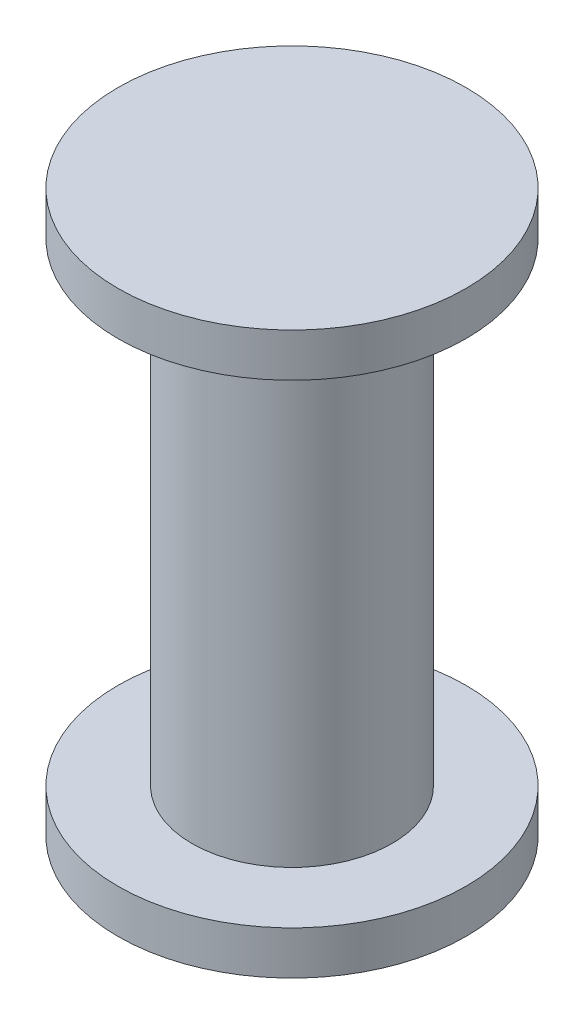
ISO-10303-21;
HEADER;
FILE_DESCRIPTION(('STEP AP214'),'2;1');
FILE_NAME('part.step','',(''),(''),'','','');
FILE_SCHEMA(('AUTOMOTIVE_DESIGN { 1 0 10303 214 1 1 1 1 }'));
ENDSEC;
DATA;
#1=APPLICATION_CONTEXT('core data for automotive mechanical design processes');
#2=APPLICATION_PROTOCOL_DEFINITION('international standard','automotive_design',2000,#1);
#3=PRODUCT_CONTEXT('',#1,'mechanical');
#4=PRODUCT('Part','Part','',(#3));
#5=PRODUCT_RELATED_PRODUCT_CATEGORY('part','',(#4));
#6=PRODUCT_DEFINITION_FORMATION('','',#4);
#7=PRODUCT_DEFINITION_CONTEXT('part definition',#1,'design');
#8=PRODUCT_DEFINITION('design','',#6,#7);
#9=PRODUCT_DEFINITION_SHAPE('','',#8);
#10=(LENGTH_UNIT() NAMED_UNIT(*) SI_UNIT(.MILLI.,.METRE.));
#11=(NAMED_UNIT(*) PLANE_ANGLE_UNIT() SI_UNIT($,.RADIAN.));
#12=(NAMED_UNIT(*) SI_UNIT($,.STERADIAN.) SOLID_ANGLE_UNIT());
#13=UNCERTAINTY_MEASURE_WITH_UNIT(LENGTH_MEASURE(1.E-05),#10,'distance_accuracy_value','');
#14=(GEOMETRIC_REPRESENTATION_CONTEXT(3) GLOBAL_UNCERTAINTY_ASSIGNED_CONTEXT((#13)) GLOBAL_UNIT_ASSIGNED_CONTEXT((#10,
#11,#12)) REPRESENTATION_CONTEXT('',''));
#15=CARTESIAN_POINT('',(0.,0.,0.));
#16=DIRECTION('',(0.,0.,1.));
#17=DIRECTION('',(1.,0.,0.));
#18=AXIS2_PLACEMENT_3D('',#15,#16,#17);
#19=CARTESIAN_POINT('',(0.,12.9,0.));
#20=DIRECTION('',(0.,-1.,0.));
#21=DIRECTION('',(0.,0.,-1.));
#22=AXIS2_PLACEMENT_3D('',#19,#20,#21);
#23=CYLINDRICAL_SURFACE('',#22,2.3);
#24=CARTESIAN_POINT('',(0.,1.,0.));
#25=DIRECTION('',(0.,1.,0.));
#26=DIRECTION('',(0.,0.,1.));
#27=AXIS2_PLACEMENT_3D('',#24,#25,#26);
#28=CIRCLE('',#27,2.3);
#29=CARTESIAN_POINT('',(0.,1.,2.3));
#30=VERTEX_POINT('',#29);
#31=EDGE_CURVE('E65',#30,#30,#28,.T.);
#32=ORIENTED_EDGE('',*,*,#31,.T.);
#33=EDGE_LOOP('',(#32));
#34=FACE_BOUND('',#33,.T.);
#35=CARTESIAN_POINT('',(0.,11.9,0.));
#36=DIRECTION('',(0.,1.,0.));
#37=DIRECTION('',(0.,0.,1.));
#38=AXIS2_PLACEMENT_3D('',#35,#36,#37);
#39=CIRCLE('',#38,2.3);
#40=CARTESIAN_POINT('',(0.,11.9,2.3));
#41=VERTEX_POINT('',#40);
#42=EDGE_CURVE('E10',#41,#41,#39,.T.);
#43=ORIENTED_EDGE('',*,*,#42,.F.);
#44=EDGE_LOOP('',(#43));
#45=FACE_BOUND('',#44,.T.);
#46=ADVANCED_FACE('F41',(#34,#45),#23,.T.);
#47=CARTESIAN_POINT('',(0.,11.9,0.));
#48=DIRECTION('',(0.,1.,0.));
#49=DIRECTION('',(0.,0.,1.));
#50=AXIS2_PLACEMENT_3D('',#47,#48,#49);
#51=CYLINDRICAL_SURFACE('',#50,4.);
#52=CARTESIAN_POINT('',(0.,11.9,0.));
#53=DIRECTION('',(0.,1.,0.));
#54=DIRECTION('',(0.,0.,1.));
#55=AXIS2_PLACEMENT_3D('',#52,#53,#54);
#56=CIRCLE('',#55,4.);
#57=CARTESIAN_POINT('',(0.,11.9,4.));
#58=VERTEX_POINT('',#57);
#59=EDGE_CURVE('E48',#58,#58,#56,.T.);
#60=ORIENTED_EDGE('',*,*,#59,.T.);
#61=EDGE_LOOP('',(#60));
#62=FACE_BOUND('',#61,.T.);
#63=CARTESIAN_POINT('',(0.,12.9,0.));
#64=DIRECTION('',(0.,1.,0.));
#65=DIRECTION('',(0.,0.,1.));
#66=AXIS2_PLACEMENT_3D('',#63,#64,#65);
#67=CIRCLE('',#66,4.);
#68=CARTESIAN_POINT('',(0.,12.9,4.));
#69=VERTEX_POINT('',#68);
#70=EDGE_CURVE('E53',#69,#69,#67,.T.);
#71=ORIENTED_EDGE('',*,*,#70,.F.);
#72=EDGE_LOOP('',(#71));
#73=FACE_BOUND('',#72,.T.);
#74=ADVANCED_FACE('F92',(#62,#73),#51,.T.);
#75=CARTESIAN_POINT('',(0.,11.9,0.));
#76=DIRECTION('',(0.,1.,0.));
#77=DIRECTION('',(0.,0.,1.));
#78=AXIS2_PLACEMENT_3D('',#75,#76,#77);
#79=PLANE('',#78);
#80=ORIENTED_EDGE('',*,*,#42,.T.);
#81=EDGE_LOOP('',(#80));
#82=FACE_BOUND('',#81,.T.);
#83=ORIENTED_EDGE('',*,*,#59,.F.);
#84=EDGE_LOOP('',(#83));
#85=FACE_BOUND('',#84,.T.);
#86=ADVANCED_FACE('F88',(#82,#85),#79,.F.);
#87=CARTESIAN_POINT('',(0.,12.9,0.));
#88=DIRECTION('',(0.,1.,0.));
#89=DIRECTION('',(0.,0.,1.));
#90=AXIS2_PLACEMENT_3D('',#87,#88,#89);
#91=PLANE('',#90);
#92=ORIENTED_EDGE('',*,*,#70,.T.);
#93=EDGE_LOOP('',(#92));
#94=FACE_BOUND('',#93,.T.);
#95=ADVANCED_FACE('F78',(#94),#91,.T.);
#96=CARTESIAN_POINT('',(0.,1.,0.));
#97=DIRECTION('',(0.,1.,0.));
#98=DIRECTION('',(0.,0.,1.));
#99=AXIS2_PLACEMENT_3D('',#96,#97,#98);
#100=PLANE('',#99);
#101=CARTESIAN_POINT('',(0.,1.,0.));
#102=DIRECTION('',(0.,1.,0.));
#103=DIRECTION('',(0.,0.,1.));
#104=AXIS2_PLACEMENT_3D('',#101,#102,#103);
#105=CIRCLE('',#104,4.);
#106=CARTESIAN_POINT('',(0.,1.,4.));
#107=VERTEX_POINT('',#106);
#108=EDGE_CURVE('E59',#107,#107,#105,.T.);
#109=ORIENTED_EDGE('',*,*,#108,.T.);
#110=EDGE_LOOP('',(#109));
#111=FACE_BOUND('',#110,.T.);
#112=ORIENTED_EDGE('',*,*,#31,.F.);
#113=EDGE_LOOP('',(#112));
#114=FACE_BOUND('',#113,.T.);
#115=ADVANCED_FACE('F75',(#111,#114),#100,.T.);
#116=CARTESIAN_POINT('',(0.,1.,0.));
#117=DIRECTION('',(0.,-1.,0.));
#118=DIRECTION('',(0.,0.,-1.));
#119=AXIS2_PLACEMENT_3D('',#116,#117,#118);
#120=CYLINDRICAL_SURFACE('',#119,4.);
#121=ORIENTED_EDGE('',*,*,#108,.F.);
#122=EDGE_LOOP('',(#121));
#123=FACE_BOUND('',#122,.T.);
#124=CARTESIAN_POINT('',(0.,0.,0.));
#125=DIRECTION('',(0.,1.,0.));
#126=DIRECTION('',(0.,0.,1.));
#127=AXIS2_PLACEMENT_3D('',#124,#125,#126);
#128=CIRCLE('',#127,4.);
#129=CARTESIAN_POINT('',(0.,0.,4.));
#130=VERTEX_POINT('',#129);
#131=EDGE_CURVE('E61',#130,#130,#128,.T.);
#132=ORIENTED_EDGE('',*,*,#131,.T.);
#133=EDGE_LOOP('',(#132));
#134=FACE_BOUND('',#133,.T.);
#135=ADVANCED_FACE('F77',(#123,#134),#120,.T.);
#136=CARTESIAN_POINT('',(0.,0.,0.));
#137=DIRECTION('',(0.,1.,0.));
#138=DIRECTION('',(0.,0.,1.));
#139=AXIS2_PLACEMENT_3D('',#136,#137,#138);
#140=PLANE('',#139);
#141=ORIENTED_EDGE('',*,*,#131,.F.);
#142=EDGE_LOOP('',(#141));
#143=FACE_BOUND('',#142,.T.);
#144=ADVANCED_FACE('F85',(#143),#140,.F.);
#145=CLOSED_SHELL('',(#46,#74,#86,#95,#115,#135,#144));
#146=MANIFOLD_SOLID_BREP('B2',#145);
#147=ADVANCED_BREP_SHAPE_REPRESENTATION('',(#18,#146),#14);
#148=SHAPE_DEFINITION_REPRESENTATION(#9,#147);
ENDSEC;
END-ISO-10303-21;
